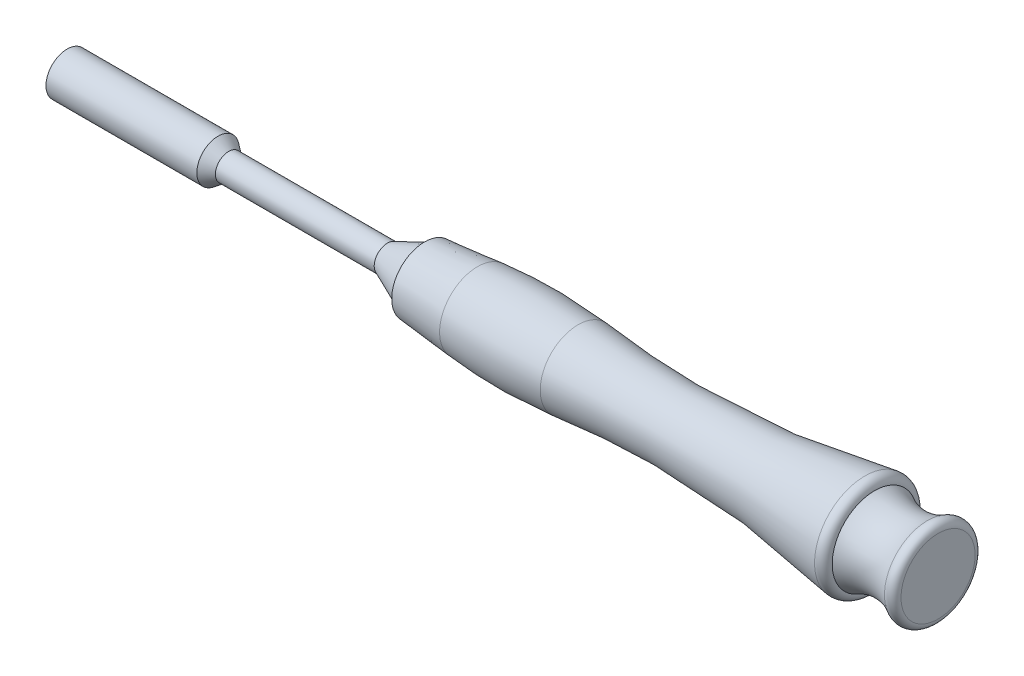
ISO-10303-21;
HEADER;
FILE_DESCRIPTION(('STEP AP214'),'2;1');
FILE_NAME('part.step','',(''),(''),'','','');
FILE_SCHEMA(('AUTOMOTIVE_DESIGN { 1 0 10303 214 1 1 1 1 }'));
ENDSEC;
DATA;
#1=APPLICATION_CONTEXT('core data for automotive mechanical design processes');
#2=APPLICATION_PROTOCOL_DEFINITION('international standard','automotive_design',2000,#1);
#3=PRODUCT_CONTEXT('',#1,'mechanical');
#4=PRODUCT('Part','Part','',(#3));
#5=PRODUCT_RELATED_PRODUCT_CATEGORY('part','',(#4));
#6=PRODUCT_DEFINITION_FORMATION('','',#4);
#7=PRODUCT_DEFINITION_CONTEXT('part definition',#1,'design');
#8=PRODUCT_DEFINITION('design','',#6,#7);
#9=PRODUCT_DEFINITION_SHAPE('','',#8);
#10=(LENGTH_UNIT() NAMED_UNIT(*) SI_UNIT(.MILLI.,.METRE.));
#11=(NAMED_UNIT(*) PLANE_ANGLE_UNIT() SI_UNIT($,.RADIAN.));
#12=(NAMED_UNIT(*) SI_UNIT($,.STERADIAN.) SOLID_ANGLE_UNIT());
#13=UNCERTAINTY_MEASURE_WITH_UNIT(LENGTH_MEASURE(1.E-05),#10,'distance_accuracy_value','');
#14=(GEOMETRIC_REPRESENTATION_CONTEXT(3) GLOBAL_UNCERTAINTY_ASSIGNED_CONTEXT((#13)) GLOBAL_UNIT_ASSIGNED_CONTEXT((#10,
#11,#12)) REPRESENTATION_CONTEXT('',''));
#15=CARTESIAN_POINT('',(0.,0.,0.));
#16=DIRECTION('',(0.,0.,1.));
#17=DIRECTION('',(1.,0.,0.));
#18=AXIS2_PLACEMENT_3D('',#15,#16,#17);
#19=CARTESIAN_POINT('',(0.,4.,0.));
#20=DIRECTION('',(-1.,0.,0.));
#21=DIRECTION('',(0.,0.,1.));
#22=AXIS2_PLACEMENT_3D('',#19,#20,#21);
#23=PLANE('',#22);
#24=DIRECTION('',(0.,-1.,0.));
#25=VECTOR('',#24,1.);
#26=CARTESIAN_POINT('',(0.,-1.61658075373095,-2.8));
#27=LINE('',#26,#25);
#28=CARTESIAN_POINT('',(0.,1.61658075373095,-2.8));
#29=VERTEX_POINT('',#28);
#30=CARTESIAN_POINT('',(0.,-1.61658075373095,-2.8));
#31=VERTEX_POINT('',#30);
#32=EDGE_CURVE('E48',#29,#31,#27,.T.);
#33=ORIENTED_EDGE('',*,*,#32,.F.);
#34=DIRECTION('',(0.,-0.5,-0.866025403784439));
#35=VECTOR('',#34,1.);
#36=CARTESIAN_POINT('',(0.,1.61658075373095,-2.8));
#37=LINE('',#36,#35);
#38=CARTESIAN_POINT('',(0.,3.2331615074619,0.));
#39=VERTEX_POINT('',#38);
#40=EDGE_CURVE('E131',#39,#29,#37,.T.);
#41=ORIENTED_EDGE('',*,*,#40,.F.);
#42=DIRECTION('',(0.,0.5,-0.866025403784439));
#43=VECTOR('',#42,1.);
#44=CARTESIAN_POINT('',(0.,3.2331615074619,0.));
#45=LINE('',#44,#43);
#46=CARTESIAN_POINT('',(0.,1.61658075373095,2.8));
#47=VERTEX_POINT('',#46);
#48=EDGE_CURVE('E129',#47,#39,#45,.T.);
#49=ORIENTED_EDGE('',*,*,#48,.F.);
#50=DIRECTION('',(0.,1.,0.));
#51=VECTOR('',#50,1.);
#52=CARTESIAN_POINT('',(0.,1.61658075373095,2.8));
#53=LINE('',#52,#51);
#54=CARTESIAN_POINT('',(0.,-1.61658075373095,2.8));
#55=VERTEX_POINT('',#54);
#56=EDGE_CURVE('E96',#55,#47,#53,.T.);
#57=ORIENTED_EDGE('',*,*,#56,.F.);
#58=DIRECTION('',(0.,0.5,0.866025403784439));
#59=VECTOR('',#58,1.);
#60=CARTESIAN_POINT('',(0.,-1.61658075373095,2.8));
#61=LINE('',#60,#59);
#62=CARTESIAN_POINT('',(0.,-3.2331615074619,0.));
#63=VERTEX_POINT('',#62);
#64=EDGE_CURVE('E125',#63,#55,#61,.T.);
#65=ORIENTED_EDGE('',*,*,#64,.F.);
#66=DIRECTION('',(0.,-0.5,0.866025403784439));
#67=VECTOR('',#66,1.);
#68=CARTESIAN_POINT('',(0.,-3.2331615074619,0.));
#69=LINE('',#68,#67);
#70=EDGE_CURVE('E122',#31,#63,#69,.T.);
#71=ORIENTED_EDGE('',*,*,#70,.F.);
#72=EDGE_LOOP('',(#33,#41,#49,#57,#65,#71));
#73=FACE_BOUND('',#72,.T.);
#74=CARTESIAN_POINT('',(0.,0.,0.));
#75=DIRECTION('',(1.,0.,0.));
#76=DIRECTION('',(0.,0.,-1.));
#77=AXIS2_PLACEMENT_3D('',#74,#75,#76);
#78=CIRCLE('',#77,4.);
#79=CARTESIAN_POINT('',(0.,0.,-4.));
#80=VERTEX_POINT('',#79);
#81=EDGE_CURVE('E135',#80,#80,#78,.T.);
#82=ORIENTED_EDGE('',*,*,#81,.F.);
#83=EDGE_LOOP('',(#82));
#84=FACE_BOUND('',#83,.T.);
#85=ADVANCED_FACE('F33',(#73,#84),#23,.T.);
#86=CARTESIAN_POINT('',(119.24,0.,0.));
#87=DIRECTION('',(1.,0.,0.));
#88=DIRECTION('',(0.,0.,-1.));
#89=AXIS2_PLACEMENT_3D('',#86,#87,#88);
#90=CYLINDRICAL_SURFACE('',#89,2.5);
#91=CARTESIAN_POINT('',(30.5,0.,0.));
#92=DIRECTION('',(1.,0.,0.));
#93=DIRECTION('',(0.,0.,-1.));
#94=AXIS2_PLACEMENT_3D('',#91,#92,#93);
#95=CIRCLE('',#94,2.5);
#96=CARTESIAN_POINT('',(30.5,0.,-2.5));
#97=VERTEX_POINT('',#96);
#98=EDGE_CURVE('E41',#97,#97,#95,.T.);
#99=ORIENTED_EDGE('',*,*,#98,.T.);
#100=EDGE_LOOP('',(#99));
#101=FACE_BOUND('',#100,.T.);
#102=CARTESIAN_POINT('',(60.5,0.,0.));
#103=DIRECTION('',(1.,0.,0.));
#104=DIRECTION('',(0.,0.,-1.));
#105=AXIS2_PLACEMENT_3D('',#102,#103,#104);
#106=CIRCLE('',#105,2.5);
#107=CARTESIAN_POINT('',(60.5,0.,-2.5));
#108=VERTEX_POINT('',#107);
#109=EDGE_CURVE('E11',#108,#108,#106,.T.);
#110=ORIENTED_EDGE('',*,*,#109,.F.);
#111=EDGE_LOOP('',(#110));
#112=FACE_BOUND('',#111,.T.);
#113=ADVANCED_FACE('F149',(#101,#112),#90,.T.);
#114=CARTESIAN_POINT('',(30.5,0.,0.));
#115=DIRECTION('',(-1.,0.,0.));
#116=DIRECTION('',(0.,0.,1.));
#117=AXIS2_PLACEMENT_3D('',#114,#115,#116);
#118=CONICAL_SURFACE('',#117,2.5,0.643501108793284);
#119=CARTESIAN_POINT('',(28.5,0.,0.));
#120=DIRECTION('',(1.,0.,0.));
#121=DIRECTION('',(0.,0.,-1.));
#122=AXIS2_PLACEMENT_3D('',#119,#120,#121);
#123=CIRCLE('',#122,4.);
#124=CARTESIAN_POINT('',(28.5,0.,-4.));
#125=VERTEX_POINT('',#124);
#126=EDGE_CURVE('E143',#125,#125,#123,.T.);
#127=ORIENTED_EDGE('',*,*,#126,.T.);
#128=EDGE_LOOP('',(#127));
#129=FACE_BOUND('',#128,.T.);
#130=ORIENTED_EDGE('',*,*,#98,.F.);
#131=EDGE_LOOP('',(#130));
#132=FACE_BOUND('',#131,.T.);
#133=ADVANCED_FACE('F152',(#129,#132),#118,.T.);
#134=CARTESIAN_POINT('',(119.24,0.,0.));
#135=DIRECTION('',(1.,0.,0.));
#136=DIRECTION('',(0.,0.,-1.));
#137=AXIS2_PLACEMENT_3D('',#134,#135,#136);
#138=CYLINDRICAL_SURFACE('',#137,4.);
#139=ORIENTED_EDGE('',*,*,#81,.T.);
#140=EDGE_LOOP('',(#139));
#141=FACE_BOUND('',#140,.T.);
#142=ORIENTED_EDGE('',*,*,#126,.F.);
#143=EDGE_LOOP('',(#142));
#144=FACE_BOUND('',#143,.T.);
#145=ADVANCED_FACE('F154',(#141,#144),#138,.T.);
#146=CARTESIAN_POINT('',(5.25,-1.61658075373095,-2.8));
#147=DIRECTION('',(0.,0.,-1.));
#148=DIRECTION('',(-1.,0.,0.));
#149=AXIS2_PLACEMENT_3D('',#146,#147,#148);
#150=PLANE('',#149);
#151=ORIENTED_EDGE('',*,*,#32,.T.);
#152=DIRECTION('',(-1.,0.,0.));
#153=VECTOR('',#152,1.);
#154=CARTESIAN_POINT('',(5.25,-1.61658075373095,-2.8));
#155=LINE('',#154,#153);
#156=CARTESIAN_POINT('',(5.25,-1.61658075373095,-2.8));
#157=VERTEX_POINT('',#156);
#158=EDGE_CURVE('E78',#157,#31,#155,.T.);
#159=ORIENTED_EDGE('',*,*,#158,.F.);
#160=DIRECTION('',(0.,-1.,0.));
#161=VECTOR('',#160,1.);
#162=CARTESIAN_POINT('',(5.25,-1.61658075373095,-2.8));
#163=LINE('',#162,#161);
#164=CARTESIAN_POINT('',(5.25,1.61658075373095,-2.8));
#165=VERTEX_POINT('',#164);
#166=EDGE_CURVE('E133',#165,#157,#163,.T.);
#167=ORIENTED_EDGE('',*,*,#166,.F.);
#168=DIRECTION('',(-1.,0.,0.));
#169=VECTOR('',#168,1.);
#170=CARTESIAN_POINT('',(5.25,1.61658075373095,-2.8));
#171=LINE('',#170,#169);
#172=EDGE_CURVE('E56',#165,#29,#171,.T.);
#173=ORIENTED_EDGE('',*,*,#172,.T.);
#174=EDGE_LOOP('',(#151,#159,#167,#173));
#175=FACE_BOUND('',#174,.T.);
#176=ADVANCED_FACE('F161',(#175),#150,.F.);
#177=CARTESIAN_POINT('',(5.25,1.61658075373095,-2.8));
#178=DIRECTION('',(0.,0.866025403784439,-0.5));
#179=DIRECTION('',(0.,0.5,0.866025403784439));
#180=AXIS2_PLACEMENT_3D('',#177,#178,#179);
#181=PLANE('',#180);
#182=ORIENTED_EDGE('',*,*,#40,.T.);
#183=ORIENTED_EDGE('',*,*,#172,.F.);
#184=DIRECTION('',(0.,-0.5,-0.866025403784439));
#185=VECTOR('',#184,1.);
#186=CARTESIAN_POINT('',(5.25,1.61658075373095,-2.8));
#187=LINE('',#186,#185);
#188=CARTESIAN_POINT('',(5.25,3.2331615074619,0.));
#189=VERTEX_POINT('',#188);
#190=EDGE_CURVE('E108',#189,#165,#187,.T.);
#191=ORIENTED_EDGE('',*,*,#190,.F.);
#192=DIRECTION('',(-1.,0.,0.));
#193=VECTOR('',#192,1.);
#194=CARTESIAN_POINT('',(5.25,3.2331615074619,0.));
#195=LINE('',#194,#193);
#196=EDGE_CURVE('E100',#189,#39,#195,.T.);
#197=ORIENTED_EDGE('',*,*,#196,.T.);
#198=EDGE_LOOP('',(#182,#183,#191,#197));
#199=FACE_BOUND('',#198,.T.);
#200=ADVANCED_FACE('F257',(#199),#181,.F.);
#201=CARTESIAN_POINT('',(5.25,3.2331615074619,0.));
#202=DIRECTION('',(0.,0.866025403784439,0.5));
#203=DIRECTION('',(0.,-0.5,0.866025403784439));
#204=AXIS2_PLACEMENT_3D('',#201,#202,#203);
#205=PLANE('',#204);
#206=ORIENTED_EDGE('',*,*,#48,.T.);
#207=ORIENTED_EDGE('',*,*,#196,.F.);
#208=DIRECTION('',(0.,0.5,-0.866025403784439));
#209=VECTOR('',#208,1.);
#210=CARTESIAN_POINT('',(5.25,3.2331615074619,0.));
#211=LINE('',#210,#209);
#212=CARTESIAN_POINT('',(5.25,1.61658075373095,2.8));
#213=VERTEX_POINT('',#212);
#214=EDGE_CURVE('E104',#213,#189,#211,.T.);
#215=ORIENTED_EDGE('',*,*,#214,.F.);
#216=DIRECTION('',(-1.,0.,0.));
#217=VECTOR('',#216,1.);
#218=CARTESIAN_POINT('',(5.25,1.61658075373095,2.8));
#219=LINE('',#218,#217);
#220=EDGE_CURVE('E89',#213,#47,#219,.T.);
#221=ORIENTED_EDGE('',*,*,#220,.T.);
#222=EDGE_LOOP('',(#206,#207,#215,#221));
#223=FACE_BOUND('',#222,.T.);
#224=ADVANCED_FACE('F105',(#223),#205,.F.);
#225=CARTESIAN_POINT('',(5.25,1.61658075373095,2.8));
#226=DIRECTION('',(0.,0.,1.));
#227=DIRECTION('',(1.,0.,0.));
#228=AXIS2_PLACEMENT_3D('',#225,#226,#227);
#229=PLANE('',#228);
#230=ORIENTED_EDGE('',*,*,#56,.T.);
#231=ORIENTED_EDGE('',*,*,#220,.F.);
#232=DIRECTION('',(0.,1.,0.));
#233=VECTOR('',#232,1.);
#234=CARTESIAN_POINT('',(5.25,1.61658075373095,2.8));
#235=LINE('',#234,#233);
#236=CARTESIAN_POINT('',(5.25,-1.61658075373095,2.8));
#237=VERTEX_POINT('',#236);
#238=EDGE_CURVE('E93',#237,#213,#235,.T.);
#239=ORIENTED_EDGE('',*,*,#238,.F.);
#240=DIRECTION('',(-1.,0.,0.));
#241=VECTOR('',#240,1.);
#242=CARTESIAN_POINT('',(5.25,-1.61658075373095,2.8));
#243=LINE('',#242,#241);
#244=EDGE_CURVE('E101',#237,#55,#243,.T.);
#245=ORIENTED_EDGE('',*,*,#244,.T.);
#246=EDGE_LOOP('',(#230,#231,#239,#245));
#247=FACE_BOUND('',#246,.T.);
#248=ADVANCED_FACE('F91',(#247),#229,.F.);
#249=CARTESIAN_POINT('',(5.25,-1.61658075373095,2.8));
#250=DIRECTION('',(0.,-0.866025403784439,0.5));
#251=DIRECTION('',(0.,-0.5,-0.866025403784439));
#252=AXIS2_PLACEMENT_3D('',#249,#250,#251);
#253=PLANE('',#252);
#254=ORIENTED_EDGE('',*,*,#64,.T.);
#255=ORIENTED_EDGE('',*,*,#244,.F.);
#256=DIRECTION('',(0.,0.5,0.866025403784439));
#257=VECTOR('',#256,1.);
#258=CARTESIAN_POINT('',(5.25,-1.61658075373095,2.8));
#259=LINE('',#258,#257);
#260=CARTESIAN_POINT('',(5.25,-3.2331615074619,0.));
#261=VERTEX_POINT('',#260);
#262=EDGE_CURVE('E114',#261,#237,#259,.T.);
#263=ORIENTED_EDGE('',*,*,#262,.F.);
#264=DIRECTION('',(-1.,0.,0.));
#265=VECTOR('',#264,1.);
#266=CARTESIAN_POINT('',(5.25,-3.2331615074619,0.));
#267=LINE('',#266,#265);
#268=EDGE_CURVE('E138',#261,#63,#267,.T.);
#269=ORIENTED_EDGE('',*,*,#268,.T.);
#270=EDGE_LOOP('',(#254,#255,#263,#269));
#271=FACE_BOUND('',#270,.T.);
#272=ADVANCED_FACE('F264',(#271),#253,.F.);
#273=CARTESIAN_POINT('',(5.25,-3.2331615074619,0.));
#274=DIRECTION('',(0.,-0.866025403784439,-0.5));
#275=DIRECTION('',(0.,0.5,-0.866025403784439));
#276=AXIS2_PLACEMENT_3D('',#273,#274,#275);
#277=PLANE('',#276);
#278=ORIENTED_EDGE('',*,*,#70,.T.);
#279=ORIENTED_EDGE('',*,*,#268,.F.);
#280=DIRECTION('',(0.,-0.5,0.866025403784439));
#281=VECTOR('',#280,1.);
#282=CARTESIAN_POINT('',(5.25,-3.2331615074619,0.));
#283=LINE('',#282,#281);
#284=EDGE_CURVE('E116',#157,#261,#283,.T.);
#285=ORIENTED_EDGE('',*,*,#284,.F.);
#286=ORIENTED_EDGE('',*,*,#158,.T.);
#287=EDGE_LOOP('',(#278,#279,#285,#286));
#288=FACE_BOUND('',#287,.T.);
#289=ADVANCED_FACE('F176',(#288),#277,.F.);
#290=CARTESIAN_POINT('',(5.25,0.,0.));
#291=DIRECTION('',(1.,0.,0.));
#292=DIRECTION('',(0.,0.,-1.));
#293=AXIS2_PLACEMENT_3D('',#290,#291,#292);
#294=PLANE('',#293);
#295=CARTESIAN_POINT('',(5.25,0.,0.));
#296=DIRECTION('',(1.,0.,0.));
#297=DIRECTION('',(0.,0.,-1.));
#298=AXIS2_PLACEMENT_3D('',#295,#296,#297);
#299=CIRCLE('',#298,2.5);
#300=CARTESIAN_POINT('',(5.25,0.,-2.5));
#301=VERTEX_POINT('',#300);
#302=EDGE_CURVE('E36',#301,#301,#299,.T.);
#303=ORIENTED_EDGE('',*,*,#302,.T.);
#304=EDGE_LOOP('',(#303));
#305=FACE_BOUND('',#304,.T.);
#306=ORIENTED_EDGE('',*,*,#166,.T.);
#307=ORIENTED_EDGE('',*,*,#284,.T.);
#308=ORIENTED_EDGE('',*,*,#262,.T.);
#309=ORIENTED_EDGE('',*,*,#238,.T.);
#310=ORIENTED_EDGE('',*,*,#214,.T.);
#311=ORIENTED_EDGE('',*,*,#190,.T.);
#312=EDGE_LOOP('',(#306,#307,#308,#309,#310,#311));
#313=FACE_BOUND('',#312,.T.);
#314=ADVANCED_FACE('F111',(#305,#313),#294,.F.);
#315=CARTESIAN_POINT('',(24.,0.,0.));
#316=DIRECTION('',(-1.,0.,0.));
#317=DIRECTION('',(0.,0.,1.));
#318=AXIS2_PLACEMENT_3D('',#315,#316,#317);
#319=CYLINDRICAL_SURFACE('',#318,2.5);
#320=CARTESIAN_POINT('',(24.,0.,0.));
#321=DIRECTION('',(-1.,0.,0.));
#322=DIRECTION('',(0.,0.,1.));
#323=AXIS2_PLACEMENT_3D('',#320,#321,#322);
#324=CIRCLE('',#323,2.5);
#325=CARTESIAN_POINT('',(24.,0.,2.5));
#326=VERTEX_POINT('',#325);
#327=EDGE_CURVE('E179',#326,#326,#324,.T.);
#328=ORIENTED_EDGE('',*,*,#327,.F.);
#329=EDGE_LOOP('',(#328));
#330=FACE_BOUND('',#329,.T.);
#331=ORIENTED_EDGE('',*,*,#302,.F.);
#332=EDGE_LOOP('',(#331));
#333=FACE_BOUND('',#332,.T.);
#334=ADVANCED_FACE('F249',(#330,#333),#319,.F.);
#335=CARTESIAN_POINT('',(24.,0.,0.));
#336=DIRECTION('',(-1.,0.,0.));
#337=DIRECTION('',(0.,0.,1.));
#338=AXIS2_PLACEMENT_3D('',#335,#336,#337);
#339=PLANE('',#338);
#340=ORIENTED_EDGE('',*,*,#327,.T.);
#341=EDGE_LOOP('',(#340));
#342=FACE_BOUND('',#341,.T.);
#343=ADVANCED_FACE('F245',(#342),#339,.T.);
#344=CARTESIAN_POINT('',(67.5,0.,0.));
#345=DIRECTION('',(1.,0.,0.));
#346=DIRECTION('',(0.,0.,-1.));
#347=AXIS2_PLACEMENT_3D('',#344,#345,#346);
#348=CONICAL_SURFACE('',#347,5.5,0.404891786285083);
#349=ORIENTED_EDGE('',*,*,#109,.T.);
#350=EDGE_LOOP('',(#349));
#351=FACE_BOUND('',#350,.T.);
#352=CARTESIAN_POINT('',(67.5,0.,0.));
#353=DIRECTION('',(1.,0.,0.));
#354=DIRECTION('',(0.,0.,-1.));
#355=AXIS2_PLACEMENT_3D('',#352,#353,#354);
#356=CIRCLE('',#355,5.5);
#357=CARTESIAN_POINT('',(67.5,0.,-5.5));
#358=VERTEX_POINT('',#357);
#359=EDGE_CURVE('E182',#358,#358,#356,.T.);
#360=ORIENTED_EDGE('',*,*,#359,.F.);
#361=EDGE_LOOP('',(#360));
#362=FACE_BOUND('',#361,.T.);
#363=ADVANCED_FACE('F241',(#351,#362),#348,.T.);
#364=CARTESIAN_POINT('',(67.5,0.,0.));
#365=DIRECTION('',(-1.,0.,0.));
#366=DIRECTION('',(0.,0.,1.));
#367=AXIS2_PLACEMENT_3D('',#364,#365,#366);
#368=PLANE('',#367);
#369=ORIENTED_EDGE('',*,*,#359,.T.);
#370=EDGE_LOOP('',(#369));
#371=FACE_BOUND('',#370,.T.);
#372=CARTESIAN_POINT('',(67.5,0.,0.));
#373=DIRECTION('',(1.,0.,0.));
#374=DIRECTION('',(0.,0.,-1.));
#375=AXIS2_PLACEMENT_3D('',#372,#373,#374);
#376=CIRCLE('',#375,6.19568388824698);
#377=CARTESIAN_POINT('',(67.5,0.,-6.19568388824698));
#378=VERTEX_POINT('',#377);
#379=EDGE_CURVE('E191',#378,#378,#376,.T.);
#380=ORIENTED_EDGE('',*,*,#379,.F.);
#381=EDGE_LOOP('',(#380));
#382=FACE_BOUND('',#381,.T.);
#383=ADVANCED_FACE('F237',(#371,#382),#368,.T.);
#384=CARTESIAN_POINT('',(87.,0.,0.));
#385=DIRECTION('',(1.,0.,0.));
#386=DIRECTION('',(0.,0.,-1.));
#387=AXIS2_PLACEMENT_3D('',#384,#385,#386);
#388=DEGENERATE_TOROIDAL_SURFACE('',#387,92.3977272467835,100.,.F.);
#389=CARTESIAN_POINT('',(77.5,0.,0.));
#390=DIRECTION('',(1.,0.,0.));
#391=DIRECTION('',(0.,0.,-1.));
#392=AXIS2_PLACEMENT_3D('',#389,#390,#391);
#393=CIRCLE('',#392,7.15);
#394=CARTESIAN_POINT('',(77.5,0.,-7.15));
#395=VERTEX_POINT('',#394);
#396=EDGE_CURVE('E188',#395,#395,#393,.T.);
#397=ORIENTED_EDGE('',*,*,#396,.T.);
#398=EDGE_LOOP('',(#397));
#399=FACE_BOUND('',#398,.T.);
#400=CARTESIAN_POINT('',(96.5,0.,0.));
#401=DIRECTION('',(1.,0.,0.));
#402=DIRECTION('',(0.,0.,-1.));
#403=AXIS2_PLACEMENT_3D('',#400,#401,#402);
#404=CIRCLE('',#403,7.15);
#405=CARTESIAN_POINT('',(96.5,0.,-7.15));
#406=VERTEX_POINT('',#405);
#407=EDGE_CURVE('E185',#406,#406,#404,.T.);
#408=ORIENTED_EDGE('',*,*,#407,.F.);
#409=EDGE_LOOP('',(#408));
#410=FACE_BOUND('',#409,.T.);
#411=ADVANCED_FACE('F233',(#399,#410),#388,.F.);
#412=CARTESIAN_POINT('',(77.5,0.,0.));
#413=DIRECTION('',(1.,0.,0.));
#414=DIRECTION('',(0.,0.,-1.));
#415=AXIS2_PLACEMENT_3D('',#412,#413,#414);
#416=CONICAL_SURFACE('',#415,7.15,0.095143479305891);
#417=ORIENTED_EDGE('',*,*,#379,.T.);
#418=EDGE_LOOP('',(#417));
#419=FACE_BOUND('',#418,.T.);
#420=ORIENTED_EDGE('',*,*,#396,.F.);
#421=EDGE_LOOP('',(#420));
#422=FACE_BOUND('',#421,.T.);
#423=ADVANCED_FACE('F229',(#419,#422),#416,.T.);
#424=CARTESIAN_POINT('',(150.970223747397,0.,0.));
#425=DIRECTION('',(1.,0.,0.));
#426=DIRECTION('',(0.,0.,-1.));
#427=AXIS2_PLACEMENT_3D('',#424,#425,#426);
#428=TOROIDAL_SURFACE('',#427,8.,1.5297762526034);
#429=CARTESIAN_POINT('',(150.669864990192,0.,0.));
#430=DIRECTION('',(1.,0.,0.));
#431=DIRECTION('',(0.,0.,-1.));
#432=AXIS2_PLACEMENT_3D('',#429,#430,#431);
#433=CIRCLE('',#432,9.50000000000001);
#434=CARTESIAN_POINT('',(150.669864990192,0.,-9.50000000000001));
#435=VERTEX_POINT('',#434);
#436=EDGE_CURVE('E197',#435,#435,#433,.T.);
#437=ORIENTED_EDGE('',*,*,#436,.T.);
#438=EDGE_LOOP('',(#437));
#439=FACE_BOUND('',#438,.T.);
#440=CARTESIAN_POINT('',(152.5,0.,0.));
#441=DIRECTION('',(1.,0.,0.));
#442=DIRECTION('',(0.,0.,-1.));
#443=AXIS2_PLACEMENT_3D('',#440,#441,#442);
#444=CIRCLE('',#443,8.);
#445=CARTESIAN_POINT('',(152.5,0.,-8.));
#446=VERTEX_POINT('',#445);
#447=EDGE_CURVE('E194',#446,#446,#444,.T.);
#448=ORIENTED_EDGE('',*,*,#447,.F.);
#449=EDGE_LOOP('',(#448));
#450=FACE_BOUND('',#449,.T.);
#451=ADVANCED_FACE('F225',(#439,#450),#428,.T.);
#452=CARTESIAN_POINT('',(116.028966963282,0.,0.));
#453=DIRECTION('',(1.,0.,0.));
#454=DIRECTION('',(0.,0.,-1.));
#455=AXIS2_PLACEMENT_3D('',#452,#453,#454);
#456=TOROIDAL_SURFACE('',#455,182.497609671884,176.431756688802);
#457=ORIENTED_EDGE('',*,*,#407,.T.);
#458=EDGE_LOOP('',(#457));
#459=FACE_BOUND('',#458,.T.);
#460=ORIENTED_EDGE('',*,*,#436,.F.);
#461=EDGE_LOOP('',(#460));
#462=FACE_BOUND('',#461,.T.);
#463=ADVANCED_FACE('F219',(#459,#462),#456,.F.);
#464=CARTESIAN_POINT('',(157.392433730316,0.,0.));
#465=DIRECTION('',(1.,0.,0.));
#466=DIRECTION('',(0.,0.,-1.));
#467=AXIS2_PLACEMENT_3D('',#464,#465,#466);
#468=TOROIDAL_SURFACE('',#467,16.5561183867437,9.85611838674373);
#469=ORIENTED_EDGE('',*,*,#447,.T.);
#470=EDGE_LOOP('',(#469));
#471=FACE_BOUND('',#470,.T.);
#472=CARTESIAN_POINT('',(162.5,0.,0.));
#473=DIRECTION('',(1.,0.,0.));
#474=DIRECTION('',(0.,0.,-1.));
#475=AXIS2_PLACEMENT_3D('',#472,#473,#474);
#476=CIRCLE('',#475,8.12665598073621);
#477=CARTESIAN_POINT('',(162.5,0.,-8.12665598073621));
#478=VERTEX_POINT('',#477);
#479=EDGE_CURVE('E200',#478,#478,#476,.T.);
#480=ORIENTED_EDGE('',*,*,#479,.F.);
#481=EDGE_LOOP('',(#480));
#482=FACE_BOUND('',#481,.T.);
#483=ADVANCED_FACE('F211',(#471,#482),#468,.F.);
#484=CARTESIAN_POINT('',(163.182661575268,0.,0.));
#485=DIRECTION('',(1.,0.,0.));
#486=DIRECTION('',(0.,0.,-1.));
#487=AXIS2_PLACEMENT_3D('',#484,#485,#486);
#488=TOROIDAL_SURFACE('',#487,7.,1.31733842473218);
#489=ORIENTED_EDGE('',*,*,#479,.T.);
#490=EDGE_LOOP('',(#489));
#491=FACE_BOUND('',#490,.T.);
#492=CARTESIAN_POINT('',(164.5,0.,0.));
#493=DIRECTION('',(1.,0.,0.));
#494=DIRECTION('',(0.,0.,-1.));
#495=AXIS2_PLACEMENT_3D('',#492,#493,#494);
#496=CIRCLE('',#495,7.);
#497=CARTESIAN_POINT('',(164.5,0.,-7.));
#498=VERTEX_POINT('',#497);
#499=EDGE_CURVE('E203',#498,#498,#496,.T.);
#500=ORIENTED_EDGE('',*,*,#499,.F.);
#501=EDGE_LOOP('',(#500));
#502=FACE_BOUND('',#501,.T.);
#503=ADVANCED_FACE('F209',(#491,#502),#488,.T.);
#504=CARTESIAN_POINT('',(164.5,0.,0.));
#505=DIRECTION('',(1.,0.,0.));
#506=DIRECTION('',(0.,0.,-1.));
#507=AXIS2_PLACEMENT_3D('',#504,#505,#506);
#508=PLANE('',#507);
#509=ORIENTED_EDGE('',*,*,#499,.T.);
#510=EDGE_LOOP('',(#509));
#511=FACE_BOUND('',#510,.T.);
#512=ADVANCED_FACE('F207',(#511),#508,.T.);
#513=CLOSED_SHELL('',(#85,#113,#133,#145,#176,#200,#224,#248,#272,#289,#314,#334,#343,#363,#383,
#411,#423,#451,#463,#483,#503,#512));
#514=MANIFOLD_SOLID_BREP('B2',#513);
#515=ADVANCED_BREP_SHAPE_REPRESENTATION('',(#18,#514),#14);
#516=SHAPE_DEFINITION_REPRESENTATION(#9,#515);
ENDSEC;
END-ISO-10303-21;
